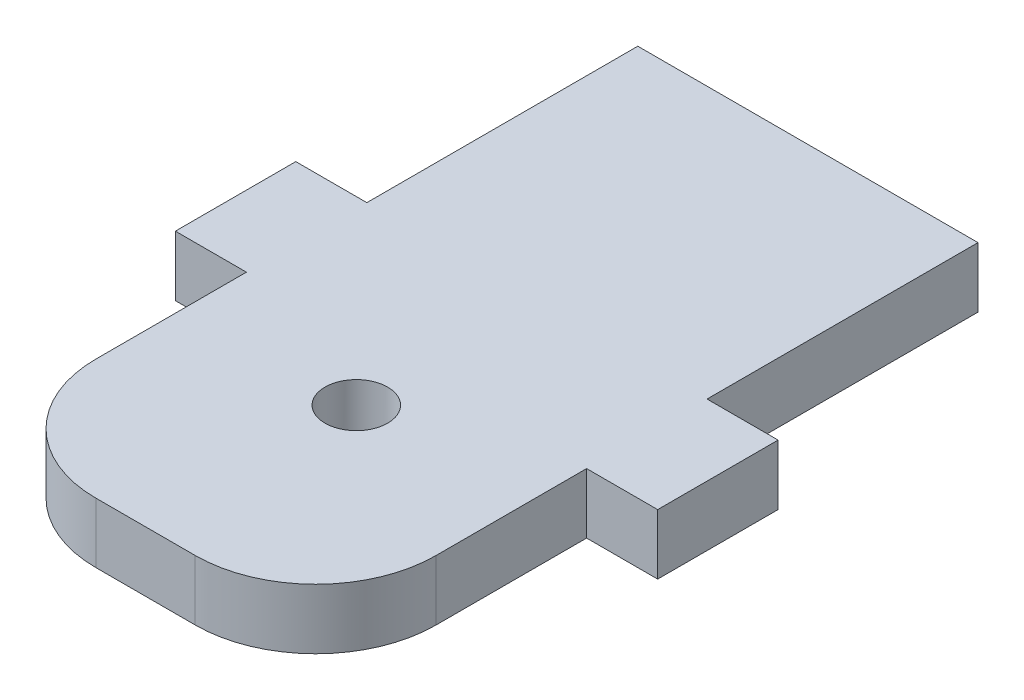
ISO-10303-21;
HEADER;
FILE_DESCRIPTION(('STEP AP214'),'2;1');
FILE_NAME('part.step','',(''),(''),'','','');
FILE_SCHEMA(('AUTOMOTIVE_DESIGN { 1 0 10303 214 1 1 1 1 }'));
ENDSEC;
DATA;
#1=APPLICATION_CONTEXT('core data for automotive mechanical design processes');
#2=APPLICATION_PROTOCOL_DEFINITION('international standard','automotive_design',2000,#1);
#3=PRODUCT_CONTEXT('',#1,'mechanical');
#4=PRODUCT('Part','Part','',(#3));
#5=PRODUCT_RELATED_PRODUCT_CATEGORY('part','',(#4));
#6=PRODUCT_DEFINITION_FORMATION('','',#4);
#7=PRODUCT_DEFINITION_CONTEXT('part definition',#1,'design');
#8=PRODUCT_DEFINITION('design','',#6,#7);
#9=PRODUCT_DEFINITION_SHAPE('','',#8);
#10=(LENGTH_UNIT() NAMED_UNIT(*) SI_UNIT(.MILLI.,.METRE.));
#11=(NAMED_UNIT(*) PLANE_ANGLE_UNIT() SI_UNIT($,.RADIAN.));
#12=(NAMED_UNIT(*) SI_UNIT($,.STERADIAN.) SOLID_ANGLE_UNIT());
#13=UNCERTAINTY_MEASURE_WITH_UNIT(LENGTH_MEASURE(1.E-05),#10,'distance_accuracy_value','');
#14=(GEOMETRIC_REPRESENTATION_CONTEXT(3) GLOBAL_UNCERTAINTY_ASSIGNED_CONTEXT((#13)) GLOBAL_UNIT_ASSIGNED_CONTEXT((#10,
#11,#12)) REPRESENTATION_CONTEXT('',''));
#15=CARTESIAN_POINT('',(0.,0.,0.));
#16=DIRECTION('',(0.,0.,1.));
#17=DIRECTION('',(1.,0.,0.));
#18=AXIS2_PLACEMENT_3D('',#15,#16,#17);
#19=CARTESIAN_POINT('',(14.125,5.00000000000142,27.5000000000015));
#20=DIRECTION('',(-1.00000000000001,0.,0.));
#21=DIRECTION('',(0.,0.,1.00000000000002));
#22=AXIS2_PLACEMENT_3D('',#19,#20,#21);
#23=PLANE('',#22);
#24=DIRECTION('',(0.,1.00000000000008,0.));
#25=VECTOR('',#24,1.);
#26=CARTESIAN_POINT('',(14.1250000000008,-11.6107708615734,-4.99999999999921));
#27=LINE('',#26,#25);
#28=CARTESIAN_POINT('',(14.125,1.94289029309402E-12,-4.99999999999897));
#29=VERTEX_POINT('',#28);
#30=CARTESIAN_POINT('',(14.1250000000018,5.00000000000164,-5.0000000000001));
#31=VERTEX_POINT('',#30);
#32=EDGE_CURVE('E166',#29,#31,#27,.T.);
#33=ORIENTED_EDGE('',*,*,#32,.F.);
#34=DIRECTION('',(0.,0.,-1.00000000000002));
#35=VECTOR('',#34,1.);
#36=CARTESIAN_POINT('',(14.1250000000007,1.01307850997046E-12,27.5000000000006));
#37=LINE('',#36,#35);
#38=CARTESIAN_POINT('',(14.1250000000008,1.49880108324396E-12,-27.5000000000018));
#39=VERTEX_POINT('',#38);
#40=EDGE_CURVE('E150',#29,#39,#37,.T.);
#41=ORIENTED_EDGE('',*,*,#40,.T.);
#42=DIRECTION('',(0.,-1.00000000000008,0.));
#43=VECTOR('',#42,1.);
#44=CARTESIAN_POINT('',(14.125,5.00000000000275,-27.500000000002));
#45=LINE('',#44,#43);
#46=CARTESIAN_POINT('',(14.125,5.00000000000275,-27.500000000002));
#47=VERTEX_POINT('',#46);
#48=EDGE_CURVE('E234',#47,#39,#45,.T.);
#49=ORIENTED_EDGE('',*,*,#48,.F.);
#50=DIRECTION('',(0.,0.,-1.00000000000002));
#51=VECTOR('',#50,1.);
#52=CARTESIAN_POINT('',(14.125,5.00000000000142,27.5000000000015));
#53=LINE('',#52,#51);
#54=EDGE_CURVE('E216',#31,#47,#53,.T.);
#55=ORIENTED_EDGE('',*,*,#54,.F.);
#56=EDGE_LOOP('',(#33,#41,#49,#55));
#57=FACE_BOUND('',#56,.T.);
#58=ADVANCED_FACE('F36',(#57),#23,.F.);
#59=CARTESIAN_POINT('',(-14.1249999999993,5.00000000000207,27.5000000000012));
#60=DIRECTION('',(1.00000000000001,0.,0.));
#61=DIRECTION('',(0.,0.,-1.00000000000002));
#62=AXIS2_PLACEMENT_3D('',#59,#60,#61);
#63=PLANE('',#62);
#64=DIRECTION('',(0.,0.,1.00000000000002));
#65=VECTOR('',#64,1.);
#66=CARTESIAN_POINT('',(-14.1250000000001,2.08166817117217E-12,27.4999999999999));
#67=LINE('',#66,#65);
#68=CARTESIAN_POINT('',(-14.1250000000007,2.95596880306448E-12,5.00000000000091));
#69=VERTEX_POINT('',#68);
#70=CARTESIAN_POINT('',(-14.1250000000001,4.23272528138341E-12,17.5000000000006));
#71=VERTEX_POINT('',#70);
#72=EDGE_CURVE('E226',#69,#71,#67,.T.);
#73=ORIENTED_EDGE('',*,*,#72,.T.);
#74=DIRECTION('',(0.,-1.00000000000008,0.));
#75=VECTOR('',#74,1.);
#76=CARTESIAN_POINT('',(-14.1249999999983,5.00000000000395,17.5000000000003));
#77=LINE('',#76,#75);
#78=CARTESIAN_POINT('',(-14.1249999999983,5.00000000000395,17.5000000000003));
#79=VERTEX_POINT('',#78);
#80=EDGE_CURVE('E11',#71,#79,#77,.F.);
#81=ORIENTED_EDGE('',*,*,#80,.T.);
#82=DIRECTION('',(0.,0.,1.00000000000002));
#83=VECTOR('',#82,1.);
#84=CARTESIAN_POINT('',(-14.1249999999993,5.00000000000207,27.5000000000012));
#85=LINE('',#84,#83);
#86=CARTESIAN_POINT('',(-14.1250000000007,5.0000000000017,5.00000000000022));
#87=VERTEX_POINT('',#86);
#88=EDGE_CURVE('E218',#87,#79,#85,.T.);
#89=ORIENTED_EDGE('',*,*,#88,.F.);
#90=DIRECTION('',(0.,1.00000000000008,0.));
#91=VECTOR('',#90,1.);
#92=CARTESIAN_POINT('',(-14.1250000000004,-11.610770861573,5.00000000000033));
#93=LINE('',#92,#91);
#94=EDGE_CURVE('E198',#69,#87,#93,.T.);
#95=ORIENTED_EDGE('',*,*,#94,.F.);
#96=EDGE_LOOP('',(#73,#81,#89,#95));
#97=FACE_BOUND('',#96,.T.);
#98=ADVANCED_FACE('F259',(#97),#63,.F.);
#99=CARTESIAN_POINT('',(14.1250000000032,5.00000000000224,17.5000000000009));
#100=VERTEX_POINT('',#99);
#101=CARTESIAN_POINT('',(14.125,5.00000000000139,5.0000000000008));
#102=VERTEX_POINT('',#101);
#103=EDGE_CURVE('E213',#100,#102,#53,.T.);
#104=ORIENTED_EDGE('',*,*,#103,.F.);
#105=DIRECTION('',(0.,-1.00000000000008,0.));
#106=VECTOR('',#105,1.);
#107=CARTESIAN_POINT('',(14.1250000000032,5.00000000000224,17.5000000000009));
#108=LINE('',#107,#106);
#109=CARTESIAN_POINT('',(14.125,2.74780198594726E-12,17.5000000000012));
#110=VERTEX_POINT('',#109);
#111=EDGE_CURVE('E147',#100,#110,#108,.T.);
#112=ORIENTED_EDGE('',*,*,#111,.T.);
#113=CARTESIAN_POINT('',(14.1250000000007,1.17961196366423E-12,5.00000000000071));
#114=VERTEX_POINT('',#113);
#115=EDGE_CURVE('E140',#110,#114,#37,.T.);
#116=ORIENTED_EDGE('',*,*,#115,.T.);
#117=DIRECTION('',(0.,1.00000000000008,0.));
#118=VECTOR('',#117,1.);
#119=CARTESIAN_POINT('',(14.125,-11.6107708615743,5.00000000000098));
#120=LINE('',#119,#118);
#121=EDGE_CURVE('E145',#114,#102,#120,.T.);
#122=ORIENTED_EDGE('',*,*,#121,.T.);
#123=EDGE_LOOP('',(#104,#112,#116,#122));
#124=FACE_BOUND('',#123,.T.);
#125=ADVANCED_FACE('F143',(#124),#23,.F.);
#126=CARTESIAN_POINT('',(-14.1249999999993,5.00000000000309,-27.5000000000008));
#127=DIRECTION('',(0.,0.,1.00000000000002));
#128=DIRECTION('',(1.00000000000001,0.,0.));
#129=AXIS2_PLACEMENT_3D('',#126,#127,#128);
#130=PLANE('',#129);
#131=DIRECTION('',(-1.00000000000001,0.,0.));
#132=VECTOR('',#131,1.);
#133=CARTESIAN_POINT('',(-14.1250000000007,4.39925873507718E-12,-27.5000000000016));
#134=LINE('',#133,#132);
#135=CARTESIAN_POINT('',(-14.1250000000007,4.39925873507718E-12,-27.5000000000016));
#136=VERTEX_POINT('',#135);
#137=EDGE_CURVE('E149',#39,#136,#134,.T.);
#138=ORIENTED_EDGE('',*,*,#137,.T.);
#139=DIRECTION('',(0.,-1.00000000000008,0.));
#140=VECTOR('',#139,1.);
#141=CARTESIAN_POINT('',(-14.1249999999993,5.00000000000309,-27.5000000000008));
#142=LINE('',#141,#140);
#143=CARTESIAN_POINT('',(-14.1249999999993,5.00000000000309,-27.5000000000008));
#144=VERTEX_POINT('',#143);
#145=EDGE_CURVE('E223',#144,#136,#142,.T.);
#146=ORIENTED_EDGE('',*,*,#145,.F.);
#147=DIRECTION('',(-1.00000000000001,0.,0.));
#148=VECTOR('',#147,1.);
#149=CARTESIAN_POINT('',(-14.1249999999993,5.00000000000309,-27.5000000000008));
#150=LINE('',#149,#148);
#151=EDGE_CURVE('E215',#47,#144,#150,.T.);
#152=ORIENTED_EDGE('',*,*,#151,.F.);
#153=ORIENTED_EDGE('',*,*,#48,.T.);
#154=EDGE_LOOP('',(#138,#146,#152,#153));
#155=FACE_BOUND('',#154,.T.);
#156=ADVANCED_FACE('F279',(#155),#130,.F.);
#157=CARTESIAN_POINT('',(-14.1250000000007,4.49640324973188E-12,-5.00000000000044));
#158=VERTEX_POINT('',#157);
#159=EDGE_CURVE('E227',#136,#158,#67,.T.);
#160=ORIENTED_EDGE('',*,*,#159,.T.);
#161=DIRECTION('',(0.,1.00000000000008,0.));
#162=VECTOR('',#161,1.);
#163=CARTESIAN_POINT('',(-14.1250000000001,-11.6107708615719,-5.));
#164=LINE('',#163,#162);
#165=CARTESIAN_POINT('',(-14.1249999999983,5.00000000000371,-5.00000000000025));
#166=VERTEX_POINT('',#165);
#167=EDGE_CURVE('E207',#158,#166,#164,.T.);
#168=ORIENTED_EDGE('',*,*,#167,.T.);
#169=EDGE_CURVE('E219',#144,#166,#85,.T.);
#170=ORIENTED_EDGE('',*,*,#169,.F.);
#171=ORIENTED_EDGE('',*,*,#145,.T.);
#172=EDGE_LOOP('',(#160,#168,#170,#171));
#173=FACE_BOUND('',#172,.T.);
#174=ADVANCED_FACE('F275',(#173),#63,.F.);
#175=CARTESIAN_POINT('',(-14.1249999999993,5.00000000000207,27.5000000000012));
#176=DIRECTION('',(0.,0.,-1.00000000000002));
#177=DIRECTION('',(-1.00000000000001,0.,0.));
#178=AXIS2_PLACEMENT_3D('',#175,#176,#177);
#179=PLANE('',#178);
#180=DIRECTION('',(1.00000000000001,0.,0.));
#181=VECTOR('',#180,1.);
#182=CARTESIAN_POINT('',(-14.1250000000001,2.08166817117217E-12,27.4999999999999));
#183=LINE('',#182,#181);
#184=CARTESIAN_POINT('',(-4.12499999999977,2.33146835171283E-12,27.5000000000006));
#185=VERTEX_POINT('',#184);
#186=CARTESIAN_POINT('',(4.12500000000002,2.31759056390501E-12,27.5000000000002));
#187=VERTEX_POINT('',#186);
#188=EDGE_CURVE('E230',#185,#187,#183,.T.);
#189=ORIENTED_EDGE('',*,*,#188,.T.);
#190=DIRECTION('',(0.,-1.00000000000008,0.));
#191=VECTOR('',#190,1.);
#192=CARTESIAN_POINT('',(4.12500000000002,5.00000000000156,27.5000000000011));
#193=LINE('',#192,#191);
#194=CARTESIAN_POINT('',(4.12500000000002,5.00000000000156,27.5000000000011));
#195=VERTEX_POINT('',#194);
#196=EDGE_CURVE('E57',#187,#195,#193,.F.);
#197=ORIENTED_EDGE('',*,*,#196,.T.);
#198=DIRECTION('',(1.00000000000001,0.,0.));
#199=VECTOR('',#198,1.);
#200=CARTESIAN_POINT('',(-14.1249999999993,5.00000000000207,27.5000000000012));
#201=LINE('',#200,#199);
#202=CARTESIAN_POINT('',(-4.12499999999855,5.00000000000309,27.5000000000014));
#203=VERTEX_POINT('',#202);
#204=EDGE_CURVE('E222',#203,#195,#201,.T.);
#205=ORIENTED_EDGE('',*,*,#204,.F.);
#206=DIRECTION('',(0.,-1.00000000000008,0.));
#207=VECTOR('',#206,1.);
#208=CARTESIAN_POINT('',(-4.12499999999855,5.00000000000309,27.5000000000014));
#209=LINE('',#208,#207);
#210=EDGE_CURVE('E242',#203,#185,#209,.T.);
#211=ORIENTED_EDGE('',*,*,#210,.T.);
#212=EDGE_LOOP('',(#189,#197,#205,#211));
#213=FACE_BOUND('',#212,.T.);
#214=ADVANCED_FACE('F253',(#213),#179,.F.);
#215=CARTESIAN_POINT('',(1.22124532708767E-12,5.00000000000002,-8.88178419700125E-13));
#216=DIRECTION('',(0.,-1.00000000000008,0.));
#217=DIRECTION('',(0.,0.,-1.00000000000002));
#218=AXIS2_PLACEMENT_3D('',#215,#216,#217);
#219=PLANE('',#218);
#220=CARTESIAN_POINT('',(0.,5.00000000000141,10.0000000000007));
#221=DIRECTION('',(0.,1.00000000000008,0.));
#222=DIRECTION('',(0.,0.,1.00000000000002));
#223=AXIS2_PLACEMENT_3D('',#220,#221,#222);
#224=CIRCLE('',#223,2.6);
#225=CARTESIAN_POINT('',(0.,5.00000000000141,12.6000000000007));
#226=VERTEX_POINT('',#225);
#227=EDGE_CURVE('E172',#226,#226,#224,.T.);
#228=ORIENTED_EDGE('',*,*,#227,.F.);
#229=EDGE_LOOP('',(#228));
#230=FACE_BOUND('',#229,.T.);
#231=ORIENTED_EDGE('',*,*,#204,.T.);
#232=CARTESIAN_POINT('',(4.12500000000318,5.00000000000257,17.5000000000008));
#233=DIRECTION('',(0.,-1.00000000000008,0.));
#234=DIRECTION('',(0.,0.,-1.00000000000002));
#235=AXIS2_PLACEMENT_3D('',#232,#233,#234);
#236=CIRCLE('',#235,10.);
#237=EDGE_CURVE('E44',#195,#100,#236,.F.);
#238=ORIENTED_EDGE('',*,*,#237,.T.);
#239=ORIENTED_EDGE('',*,*,#103,.T.);
#240=DIRECTION('',(1.00000000000001,0.,0.));
#241=VECTOR('',#240,1.);
#242=CARTESIAN_POINT('',(14.125,5.00000000000139,5.0000000000008));
#243=LINE('',#242,#241);
#244=CARTESIAN_POINT('',(20.025000000002,5.00000000000123,4.99999999999857));
#245=VERTEX_POINT('',#244);
#246=EDGE_CURVE('E165',#102,#245,#243,.T.);
#247=ORIENTED_EDGE('',*,*,#246,.T.);
#248=DIRECTION('',(0.,0.,-1.00000000000002));
#249=VECTOR('',#248,1.);
#250=CARTESIAN_POINT('',(20.0250000000001,5.00000000000103,-5.00000000000179));
#251=LINE('',#250,#249);
#252=CARTESIAN_POINT('',(20.0250000000001,5.00000000000103,-5.00000000000179));
#253=VERTEX_POINT('',#252);
#254=EDGE_CURVE('E183',#245,#253,#251,.T.);
#255=ORIENTED_EDGE('',*,*,#254,.T.);
#256=DIRECTION('',(-1.00000000000001,0.,0.));
#257=VECTOR('',#256,1.);
#258=CARTESIAN_POINT('',(14.1250000000018,5.00000000000164,-5.0000000000001));
#259=LINE('',#258,#257);
#260=EDGE_CURVE('E159',#253,#31,#259,.T.);
#261=ORIENTED_EDGE('',*,*,#260,.T.);
#262=ORIENTED_EDGE('',*,*,#54,.T.);
#263=ORIENTED_EDGE('',*,*,#151,.T.);
#264=ORIENTED_EDGE('',*,*,#169,.T.);
#265=DIRECTION('',(-1.00000000000001,0.,0.));
#266=VECTOR('',#265,1.);
#267=CARTESIAN_POINT('',(-14.1249999999983,5.00000000000371,-5.00000000000025));
#268=LINE('',#267,#266);
#269=CARTESIAN_POINT('',(-20.0249999999993,5.00000000000315,-5.00000000000091));
#270=VERTEX_POINT('',#269);
#271=EDGE_CURVE('E188',#166,#270,#268,.T.);
#272=ORIENTED_EDGE('',*,*,#271,.T.);
#273=DIRECTION('',(0.,0.,1.00000000000002));
#274=VECTOR('',#273,1.);
#275=CARTESIAN_POINT('',(-20.0249999999993,5.00000000000315,-5.00000000000091));
#276=LINE('',#275,#274);
#277=CARTESIAN_POINT('',(-20.0249999999989,5.00000000000161,4.99999999999992));
#278=VERTEX_POINT('',#277);
#279=EDGE_CURVE('E182',#270,#278,#276,.T.);
#280=ORIENTED_EDGE('',*,*,#279,.T.);
#281=DIRECTION('',(1.00000000000001,0.,0.));
#282=VECTOR('',#281,1.);
#283=CARTESIAN_POINT('',(-14.1250000000007,5.0000000000017,5.00000000000022));
#284=LINE('',#283,#282);
#285=EDGE_CURVE('E192',#278,#87,#284,.T.);
#286=ORIENTED_EDGE('',*,*,#285,.T.);
#287=ORIENTED_EDGE('',*,*,#88,.T.);
#288=CARTESIAN_POINT('',(-4.12499999999756,5.00000000000354,17.5000000000011));
#289=DIRECTION('',(0.,-1.00000000000008,0.));
#290=DIRECTION('',(0.,0.,-1.00000000000002));
#291=AXIS2_PLACEMENT_3D('',#288,#289,#290);
#292=CIRCLE('',#291,10.);
#293=EDGE_CURVE('E246',#79,#203,#292,.F.);
#294=ORIENTED_EDGE('',*,*,#293,.T.);
#295=EDGE_LOOP('',(#231,#238,#239,#247,#255,#261,#262,#263,#264,#272,#280,#286,#287,#294));
#296=FACE_BOUND('',#295,.T.);
#297=ADVANCED_FACE('F249',(#230,#296),#219,.F.);
#298=CARTESIAN_POINT('',(0.,0.,0.));
#299=DIRECTION('',(0.,-1.00000000000008,0.));
#300=DIRECTION('',(0.,0.,-1.00000000000002));
#301=AXIS2_PLACEMENT_3D('',#298,#299,#300);
#302=PLANE('',#301);
#303=CARTESIAN_POINT('',(1.22124532708767E-12,5.96744875736022E-13,10.0000000000008));
#304=DIRECTION('',(0.,-1.00000000000008,0.));
#305=DIRECTION('',(0.,0.,-1.00000000000002));
#306=AXIS2_PLACEMENT_3D('',#303,#304,#305);
#307=CIRCLE('',#306,2.6);
#308=CARTESIAN_POINT('',(1.22124532708994E-12,5.96744875736022E-13,7.40000000000071));
#309=VERTEX_POINT('',#308);
#310=EDGE_CURVE('E167',#309,#309,#307,.T.);
#311=ORIENTED_EDGE('',*,*,#310,.F.);
#312=EDGE_LOOP('',(#311));
#313=FACE_BOUND('',#312,.T.);
#314=ORIENTED_EDGE('',*,*,#115,.F.);
#315=CARTESIAN_POINT('',(4.125,1.60982338570648E-12,17.5000000000007));
#316=DIRECTION('',(0.,-1.00000000000008,0.));
#317=DIRECTION('',(0.,0.,-1.00000000000002));
#318=AXIS2_PLACEMENT_3D('',#315,#316,#317);
#319=CIRCLE('',#318,10.);
#320=EDGE_CURVE('E240',#110,#187,#319,.T.);
#321=ORIENTED_EDGE('',*,*,#320,.T.);
#322=ORIENTED_EDGE('',*,*,#188,.F.);
#323=CARTESIAN_POINT('',(-4.12499999999977,3.2612801348364E-12,17.5000000000011));
#324=DIRECTION('',(0.,-1.00000000000008,0.));
#325=DIRECTION('',(0.,0.,-1.00000000000002));
#326=AXIS2_PLACEMENT_3D('',#323,#324,#325);
#327=CIRCLE('',#326,10.);
#328=EDGE_CURVE('E238',#185,#71,#327,.T.);
#329=ORIENTED_EDGE('',*,*,#328,.T.);
#330=ORIENTED_EDGE('',*,*,#72,.F.);
#331=DIRECTION('',(1.00000000000001,0.,0.));
#332=VECTOR('',#331,1.);
#333=CARTESIAN_POINT('',(-14.1250000000007,2.95596880306448E-12,5.00000000000091));
#334=LINE('',#333,#332);
#335=CARTESIAN_POINT('',(-20.0250000000001,2.692290834716E-12,4.99999999999973));
#336=VERTEX_POINT('',#335);
#337=EDGE_CURVE('E191',#336,#69,#334,.T.);
#338=ORIENTED_EDGE('',*,*,#337,.F.);
#339=DIRECTION('',(0.,0.,1.00000000000002));
#340=VECTOR('',#339,1.);
#341=CARTESIAN_POINT('',(-20.0250000000008,4.52415882534751E-12,-5.00000000000098));
#342=LINE('',#341,#340);
#343=CARTESIAN_POINT('',(-20.0250000000008,4.52415882534751E-12,-5.00000000000098));
#344=VERTEX_POINT('',#343);
#345=EDGE_CURVE('E199',#344,#336,#342,.T.);
#346=ORIENTED_EDGE('',*,*,#345,.F.);
#347=DIRECTION('',(-1.00000000000001,0.,0.));
#348=VECTOR('',#347,1.);
#349=CARTESIAN_POINT('',(-14.1250000000007,4.49640324973188E-12,-5.00000000000044));
#350=LINE('',#349,#348);
#351=EDGE_CURVE('E204',#158,#344,#350,.T.);
#352=ORIENTED_EDGE('',*,*,#351,.F.);
#353=ORIENTED_EDGE('',*,*,#159,.F.);
#354=ORIENTED_EDGE('',*,*,#137,.F.);
#355=ORIENTED_EDGE('',*,*,#40,.F.);
#356=DIRECTION('',(-1.00000000000001,0.,0.));
#357=VECTOR('',#356,1.);
#358=CARTESIAN_POINT('',(14.125,1.94289029309402E-12,-4.99999999999897));
#359=LINE('',#358,#357);
#360=CARTESIAN_POINT('',(20.0249999999993,1.87350135405495E-12,-5.00000000000125));
#361=VERTEX_POINT('',#360);
#362=EDGE_CURVE('E169',#361,#29,#359,.T.);
#363=ORIENTED_EDGE('',*,*,#362,.F.);
#364=DIRECTION('',(0.,0.,-1.00000000000002));
#365=VECTOR('',#364,1.);
#366=CARTESIAN_POINT('',(20.0249999999993,1.87350135405495E-12,-5.00000000000125));
#367=LINE('',#366,#365);
#368=CARTESIAN_POINT('',(20.025000000002,6.38378239159465E-13,4.99999999999914));
#369=VERTEX_POINT('',#368);
#370=EDGE_CURVE('E156',#369,#361,#367,.T.);
#371=ORIENTED_EDGE('',*,*,#370,.F.);
#372=DIRECTION('',(1.00000000000001,0.,0.));
#373=VECTOR('',#372,1.);
#374=CARTESIAN_POINT('',(14.1250000000007,1.17961196366423E-12,5.00000000000071));
#375=LINE('',#374,#373);
#376=EDGE_CURVE('E153',#114,#369,#375,.T.);
#377=ORIENTED_EDGE('',*,*,#376,.F.);
#378=EDGE_LOOP('',(#314,#321,#322,#329,#330,#338,#346,#352,#353,#354,#355,#363,#371,#377));
#379=FACE_BOUND('',#378,.T.);
#380=ADVANCED_FACE('F154',(#313,#379),#302,.T.);
#381=CARTESIAN_POINT('',(-14.1250000000004,-11.610770861573,5.00000000000033));
#382=DIRECTION('',(0.,0.,1.00000000000002));
#383=DIRECTION('',(1.00000000000001,0.,0.));
#384=AXIS2_PLACEMENT_3D('',#381,#382,#383);
#385=PLANE('',#384);
#386=DIRECTION('',(0.,1.00000000000008,0.));
#387=VECTOR('',#386,1.);
#388=CARTESIAN_POINT('',(-20.0250000000008,-11.6107708615727,5.00000000000034));
#389=LINE('',#388,#387);
#390=EDGE_CURVE('E202',#336,#278,#389,.T.);
#391=ORIENTED_EDGE('',*,*,#390,.F.);
#392=ORIENTED_EDGE('',*,*,#337,.T.);
#393=ORIENTED_EDGE('',*,*,#94,.T.);
#394=ORIENTED_EDGE('',*,*,#285,.F.);
#395=EDGE_LOOP('',(#391,#392,#393,#394));
#396=FACE_BOUND('',#395,.T.);
#397=ADVANCED_FACE('F263',(#396),#385,.T.);
#398=CARTESIAN_POINT('',(-14.1250000000001,-11.6107708615719,-5.));
#399=DIRECTION('',(0.,0.,-1.00000000000002));
#400=DIRECTION('',(-1.00000000000001,0.,0.));
#401=AXIS2_PLACEMENT_3D('',#398,#399,#400);
#402=PLANE('',#401);
#403=ORIENTED_EDGE('',*,*,#167,.F.);
#404=ORIENTED_EDGE('',*,*,#351,.T.);
#405=DIRECTION('',(0.,1.00000000000008,0.));
#406=VECTOR('',#405,1.);
#407=CARTESIAN_POINT('',(-20.0250000000008,-11.6107708615726,-5.00000000000085));
#408=LINE('',#407,#406);
#409=EDGE_CURVE('E203',#344,#270,#408,.T.);
#410=ORIENTED_EDGE('',*,*,#409,.T.);
#411=ORIENTED_EDGE('',*,*,#271,.F.);
#412=EDGE_LOOP('',(#403,#404,#410,#411));
#413=FACE_BOUND('',#412,.T.);
#414=ADVANCED_FACE('F272',(#413),#402,.T.);
#415=CARTESIAN_POINT('',(-20.0250000000008,-11.6107708615726,-5.00000000000085));
#416=DIRECTION('',(-1.00000000000001,0.,0.));
#417=DIRECTION('',(0.,0.,1.00000000000002));
#418=AXIS2_PLACEMENT_3D('',#415,#416,#417);
#419=PLANE('',#418);
#420=ORIENTED_EDGE('',*,*,#409,.F.);
#421=ORIENTED_EDGE('',*,*,#345,.T.);
#422=ORIENTED_EDGE('',*,*,#390,.T.);
#423=ORIENTED_EDGE('',*,*,#279,.F.);
#424=EDGE_LOOP('',(#420,#421,#422,#423));
#425=FACE_BOUND('',#424,.T.);
#426=ADVANCED_FACE('F267',(#425),#419,.T.);
#427=CARTESIAN_POINT('',(14.125,-11.6107708615743,5.00000000000098));
#428=DIRECTION('',(0.,0.,1.00000000000002));
#429=DIRECTION('',(1.00000000000001,0.,0.));
#430=AXIS2_PLACEMENT_3D('',#427,#428,#429);
#431=PLANE('',#430);
#432=ORIENTED_EDGE('',*,*,#121,.F.);
#433=ORIENTED_EDGE('',*,*,#376,.T.);
#434=DIRECTION('',(0.,1.00000000000008,0.));
#435=VECTOR('',#434,1.);
#436=CARTESIAN_POINT('',(20.025000000002,-11.6107708615738,4.99999999999989));
#437=LINE('',#436,#435);
#438=EDGE_CURVE('E160',#369,#245,#437,.T.);
#439=ORIENTED_EDGE('',*,*,#438,.T.);
#440=ORIENTED_EDGE('',*,*,#246,.F.);
#441=EDGE_LOOP('',(#432,#433,#439,#440));
#442=FACE_BOUND('',#441,.T.);
#443=ADVANCED_FACE('F163',(#442),#431,.T.);
#444=CARTESIAN_POINT('',(20.0250000000001,-11.6107708615747,-5.00000000000161));
#445=DIRECTION('',(1.00000000000001,0.,0.));
#446=DIRECTION('',(0.,0.,-1.00000000000002));
#447=AXIS2_PLACEMENT_3D('',#444,#445,#446);
#448=PLANE('',#447);
#449=ORIENTED_EDGE('',*,*,#438,.F.);
#450=ORIENTED_EDGE('',*,*,#370,.T.);
#451=DIRECTION('',(0.,1.00000000000008,0.));
#452=VECTOR('',#451,1.);
#453=CARTESIAN_POINT('',(20.0250000000001,-11.6107708615747,-5.00000000000161));
#454=LINE('',#453,#452);
#455=EDGE_CURVE('E177',#361,#253,#454,.T.);
#456=ORIENTED_EDGE('',*,*,#455,.T.);
#457=ORIENTED_EDGE('',*,*,#254,.F.);
#458=EDGE_LOOP('',(#449,#450,#456,#457));
#459=FACE_BOUND('',#458,.T.);
#460=ADVANCED_FACE('F291',(#459),#448,.T.);
#461=CARTESIAN_POINT('',(14.1250000000008,-11.6107708615734,-4.99999999999921));
#462=DIRECTION('',(0.,0.,-1.00000000000002));
#463=DIRECTION('',(-1.00000000000001,0.,0.));
#464=AXIS2_PLACEMENT_3D('',#461,#462,#463);
#465=PLANE('',#464);
#466=ORIENTED_EDGE('',*,*,#455,.F.);
#467=ORIENTED_EDGE('',*,*,#362,.T.);
#468=ORIENTED_EDGE('',*,*,#32,.T.);
#469=ORIENTED_EDGE('',*,*,#260,.F.);
#470=EDGE_LOOP('',(#466,#467,#468,#469));
#471=FACE_BOUND('',#470,.T.);
#472=ADVANCED_FACE('F288',(#471),#465,.T.);
#473=CARTESIAN_POINT('',(0.,-4.9999999999992,10.0000000000009));
#474=DIRECTION('',(0.,1.00000000000008,0.));
#475=DIRECTION('',(0.,0.,1.00000000000002));
#476=AXIS2_PLACEMENT_3D('',#473,#474,#475);
#477=CYLINDRICAL_SURFACE('',#476,2.6);
#478=ORIENTED_EDGE('',*,*,#310,.T.);
#479=EDGE_LOOP('',(#478));
#480=FACE_BOUND('',#479,.T.);
#481=ORIENTED_EDGE('',*,*,#227,.T.);
#482=EDGE_LOOP('',(#481));
#483=FACE_BOUND('',#482,.T.);
#484=ADVANCED_FACE('F298',(#480,#483),#477,.F.);
#485=CARTESIAN_POINT('',(4.12500000000318,5.00000000000257,17.5000000000008));
#486=DIRECTION('',(0.,-1.00000000000008,0.));
#487=DIRECTION('',(0.,0.,-1.00000000000002));
#488=AXIS2_PLACEMENT_3D('',#485,#486,#487);
#489=CYLINDRICAL_SURFACE('',#488,10.);
#490=ORIENTED_EDGE('',*,*,#237,.F.);
#491=ORIENTED_EDGE('',*,*,#196,.F.);
#492=ORIENTED_EDGE('',*,*,#320,.F.);
#493=ORIENTED_EDGE('',*,*,#111,.F.);
#494=EDGE_LOOP('',(#490,#491,#492,#493));
#495=FACE_BOUND('',#494,.T.);
#496=ADVANCED_FACE('F251',(#495),#489,.T.);
#497=CARTESIAN_POINT('',(-4.12499999999756,5.00000000000354,17.5000000000011));
#498=DIRECTION('',(0.,-1.00000000000008,0.));
#499=DIRECTION('',(0.,0.,-1.00000000000002));
#500=AXIS2_PLACEMENT_3D('',#497,#498,#499);
#501=CYLINDRICAL_SURFACE('',#500,10.);
#502=ORIENTED_EDGE('',*,*,#293,.F.);
#503=ORIENTED_EDGE('',*,*,#80,.F.);
#504=ORIENTED_EDGE('',*,*,#328,.F.);
#505=ORIENTED_EDGE('',*,*,#210,.F.);
#506=EDGE_LOOP('',(#502,#503,#504,#505));
#507=FACE_BOUND('',#506,.T.);
#508=ADVANCED_FACE('F38',(#507),#501,.T.);
#509=CLOSED_SHELL('',(#58,#98,#125,#156,#174,#214,#297,#380,#397,#414,#426,#443,#460,#472,#484,
#496,#508));
#510=MANIFOLD_SOLID_BREP('B2',#509);
#511=ADVANCED_BREP_SHAPE_REPRESENTATION('',(#18,#510),#14);
#512=SHAPE_DEFINITION_REPRESENTATION(#9,#511);
ENDSEC;
END-ISO-10303-21;
